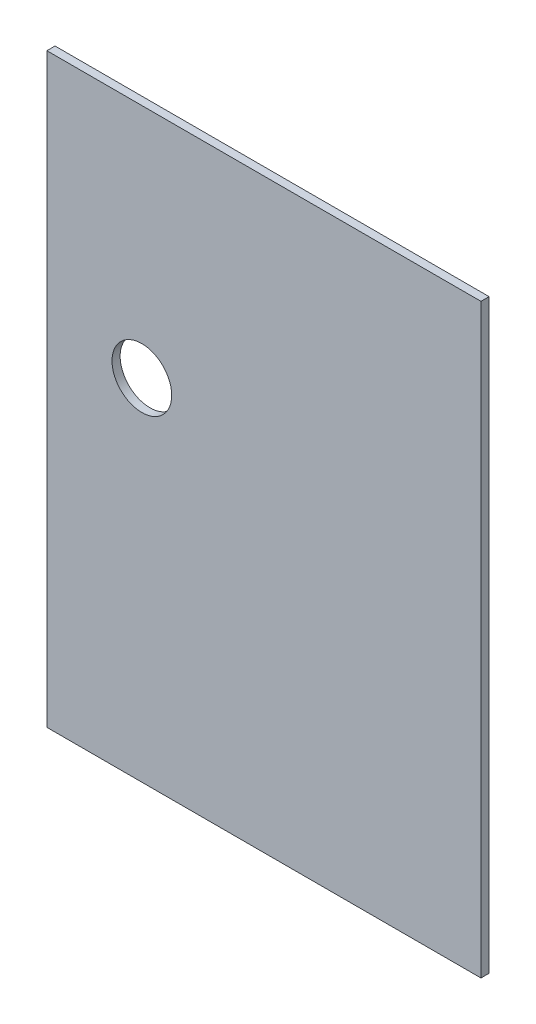
ISO-10303-21;
HEADER;
FILE_DESCRIPTION(('STEP AP214'),'2;1');
FILE_NAME('part.step','',(''),(''),'','','');
FILE_SCHEMA(('AUTOMOTIVE_DESIGN { 1 0 10303 214 1 1 1 1 }'));
ENDSEC;
DATA;
#1=APPLICATION_CONTEXT('core data for automotive mechanical design processes');
#2=APPLICATION_PROTOCOL_DEFINITION('international standard','automotive_design',2000,#1);
#3=PRODUCT_CONTEXT('',#1,'mechanical');
#4=PRODUCT('Part','Part','',(#3));
#5=PRODUCT_RELATED_PRODUCT_CATEGORY('part','',(#4));
#6=PRODUCT_DEFINITION_FORMATION('','',#4);
#7=PRODUCT_DEFINITION_CONTEXT('part definition',#1,'design');
#8=PRODUCT_DEFINITION('design','',#6,#7);
#9=PRODUCT_DEFINITION_SHAPE('','',#8);
#10=(LENGTH_UNIT() NAMED_UNIT(*) SI_UNIT(.MILLI.,.METRE.));
#11=(NAMED_UNIT(*) PLANE_ANGLE_UNIT() SI_UNIT($,.RADIAN.));
#12=(NAMED_UNIT(*) SI_UNIT($,.STERADIAN.) SOLID_ANGLE_UNIT());
#13=UNCERTAINTY_MEASURE_WITH_UNIT(LENGTH_MEASURE(1.E-05),#10,'distance_accuracy_value','');
#14=(GEOMETRIC_REPRESENTATION_CONTEXT(3) GLOBAL_UNCERTAINTY_ASSIGNED_CONTEXT((#13)) GLOBAL_UNIT_ASSIGNED_CONTEXT((#10,
#11,#12)) REPRESENTATION_CONTEXT('',''));
#15=CARTESIAN_POINT('',(0.,0.,0.));
#16=DIRECTION('',(0.,0.,1.));
#17=DIRECTION('',(1.,0.,0.));
#18=AXIS2_PLACEMENT_3D('',#15,#16,#17);
#19=CARTESIAN_POINT('',(0.,0.,3.));
#20=DIRECTION('',(1.,0.,0.));
#21=DIRECTION('',(0.,0.,-1.));
#22=AXIS2_PLACEMENT_3D('',#19,#20,#21);
#23=PLANE('',#22);
#24=DIRECTION('',(0.,-1.,0.));
#25=VECTOR('',#24,1.);
#26=CARTESIAN_POINT('',(0.,0.,0.));
#27=LINE('',#26,#25);
#28=CARTESIAN_POINT('',(0.,216.,0.));
#29=VERTEX_POINT('',#28);
#30=CARTESIAN_POINT('',(0.,0.,0.));
#31=VERTEX_POINT('',#30);
#32=EDGE_CURVE('E114',#29,#31,#27,.T.);
#33=ORIENTED_EDGE('',*,*,#32,.T.);
#34=DIRECTION('',(0.,0.,-1.));
#35=VECTOR('',#34,1.);
#36=CARTESIAN_POINT('',(0.,0.,3.));
#37=LINE('',#36,#35);
#38=CARTESIAN_POINT('',(0.,0.,3.));
#39=VERTEX_POINT('',#38);
#40=EDGE_CURVE('E11',#39,#31,#37,.T.);
#41=ORIENTED_EDGE('',*,*,#40,.F.);
#42=DIRECTION('',(0.,-1.,0.));
#43=VECTOR('',#42,1.);
#44=CARTESIAN_POINT('',(0.,0.,3.));
#45=LINE('',#44,#43);
#46=CARTESIAN_POINT('',(0.,216.,3.));
#47=VERTEX_POINT('',#46);
#48=EDGE_CURVE('E100',#47,#39,#45,.T.);
#49=ORIENTED_EDGE('',*,*,#48,.F.);
#50=DIRECTION('',(0.,0.,-1.));
#51=VECTOR('',#50,1.);
#52=CARTESIAN_POINT('',(0.,216.,3.));
#53=LINE('',#52,#51);
#54=EDGE_CURVE('E108',#47,#29,#53,.T.);
#55=ORIENTED_EDGE('',*,*,#54,.T.);
#56=EDGE_LOOP('',(#33,#41,#49,#55));
#57=FACE_BOUND('',#56,.T.);
#58=ADVANCED_FACE('F44',(#57),#23,.F.);
#59=CARTESIAN_POINT('',(0.,0.,3.));
#60=DIRECTION('',(0.,1.,0.));
#61=DIRECTION('',(0.,0.,1.));
#62=AXIS2_PLACEMENT_3D('',#59,#60,#61);
#63=PLANE('',#62);
#64=DIRECTION('',(1.,0.,0.));
#65=VECTOR('',#64,1.);
#66=CARTESIAN_POINT('',(0.,0.,0.));
#67=LINE('',#66,#65);
#68=CARTESIAN_POINT('',(160.,0.,0.));
#69=VERTEX_POINT('',#68);
#70=EDGE_CURVE('E105',#31,#69,#67,.T.);
#71=ORIENTED_EDGE('',*,*,#70,.T.);
#72=DIRECTION('',(0.,0.,-1.));
#73=VECTOR('',#72,1.);
#74=CARTESIAN_POINT('',(160.,0.,3.));
#75=LINE('',#74,#73);
#76=CARTESIAN_POINT('',(160.,0.,3.));
#77=VERTEX_POINT('',#76);
#78=EDGE_CURVE('E53',#77,#69,#75,.T.);
#79=ORIENTED_EDGE('',*,*,#78,.F.);
#80=DIRECTION('',(1.,0.,0.));
#81=VECTOR('',#80,1.);
#82=CARTESIAN_POINT('',(0.,0.,3.));
#83=LINE('',#82,#81);
#84=EDGE_CURVE('E95',#39,#77,#83,.T.);
#85=ORIENTED_EDGE('',*,*,#84,.F.);
#86=ORIENTED_EDGE('',*,*,#40,.T.);
#87=EDGE_LOOP('',(#71,#79,#85,#86));
#88=FACE_BOUND('',#87,.T.);
#89=ADVANCED_FACE('F101',(#88),#63,.F.);
#90=CARTESIAN_POINT('',(160.,0.,3.));
#91=DIRECTION('',(-1.,0.,0.));
#92=DIRECTION('',(0.,0.,1.));
#93=AXIS2_PLACEMENT_3D('',#90,#91,#92);
#94=PLANE('',#93);
#95=DIRECTION('',(0.,1.,0.));
#96=VECTOR('',#95,1.);
#97=CARTESIAN_POINT('',(160.,0.,0.));
#98=LINE('',#97,#96);
#99=CARTESIAN_POINT('',(160.,216.,0.));
#100=VERTEX_POINT('',#99);
#101=EDGE_CURVE('E80',#69,#100,#98,.T.);
#102=ORIENTED_EDGE('',*,*,#101,.T.);
#103=DIRECTION('',(0.,0.,-1.));
#104=VECTOR('',#103,1.);
#105=CARTESIAN_POINT('',(160.,216.,3.));
#106=LINE('',#105,#104);
#107=CARTESIAN_POINT('',(160.,216.,3.));
#108=VERTEX_POINT('',#107);
#109=EDGE_CURVE('E102',#108,#100,#106,.T.);
#110=ORIENTED_EDGE('',*,*,#109,.F.);
#111=DIRECTION('',(0.,1.,0.));
#112=VECTOR('',#111,1.);
#113=CARTESIAN_POINT('',(160.,0.,3.));
#114=LINE('',#113,#112);
#115=EDGE_CURVE('E92',#77,#108,#114,.T.);
#116=ORIENTED_EDGE('',*,*,#115,.F.);
#117=ORIENTED_EDGE('',*,*,#78,.T.);
#118=EDGE_LOOP('',(#102,#110,#116,#117));
#119=FACE_BOUND('',#118,.T.);
#120=ADVANCED_FACE('F104',(#119),#94,.F.);
#121=CARTESIAN_POINT('',(0.,216.,3.));
#122=DIRECTION('',(0.,-1.,0.));
#123=DIRECTION('',(0.,0.,-1.));
#124=AXIS2_PLACEMENT_3D('',#121,#122,#123);
#125=PLANE('',#124);
#126=DIRECTION('',(-1.,0.,0.));
#127=VECTOR('',#126,1.);
#128=CARTESIAN_POINT('',(0.,216.,0.));
#129=LINE('',#128,#127);
#130=EDGE_CURVE('E84',#100,#29,#129,.T.);
#131=ORIENTED_EDGE('',*,*,#130,.T.);
#132=ORIENTED_EDGE('',*,*,#54,.F.);
#133=DIRECTION('',(-1.,0.,0.));
#134=VECTOR('',#133,1.);
#135=CARTESIAN_POINT('',(0.,216.,3.));
#136=LINE('',#135,#134);
#137=EDGE_CURVE('E64',#108,#47,#136,.T.);
#138=ORIENTED_EDGE('',*,*,#137,.F.);
#139=ORIENTED_EDGE('',*,*,#109,.T.);
#140=EDGE_LOOP('',(#131,#132,#138,#139));
#141=FACE_BOUND('',#140,.T.);
#142=ADVANCED_FACE('F130',(#141),#125,.F.);
#143=CARTESIAN_POINT('',(0.,0.,3.));
#144=DIRECTION('',(0.,0.,-1.));
#145=DIRECTION('',(-1.,0.,0.));
#146=AXIS2_PLACEMENT_3D('',#143,#144,#145);
#147=PLANE('',#146);
#148=CARTESIAN_POINT('',(35.,129.,3.));
#149=DIRECTION('',(0.,0.,1.));
#150=DIRECTION('',(1.,0.,0.));
#151=AXIS2_PLACEMENT_3D('',#148,#149,#150);
#152=CIRCLE('',#151,11.);
#153=CARTESIAN_POINT('',(46.,129.,3.));
#154=VERTEX_POINT('',#153);
#155=EDGE_CURVE('E135',#154,#154,#152,.T.);
#156=ORIENTED_EDGE('',*,*,#155,.F.);
#157=EDGE_LOOP('',(#156));
#158=FACE_BOUND('',#157,.T.);
#159=ORIENTED_EDGE('',*,*,#48,.T.);
#160=ORIENTED_EDGE('',*,*,#84,.T.);
#161=ORIENTED_EDGE('',*,*,#115,.T.);
#162=ORIENTED_EDGE('',*,*,#137,.T.);
#163=EDGE_LOOP('',(#159,#160,#161,#162));
#164=FACE_BOUND('',#163,.T.);
#165=ADVANCED_FACE('F91',(#158,#164),#147,.F.);
#166=CARTESIAN_POINT('',(0.,0.,0.));
#167=DIRECTION('',(0.,0.,-1.));
#168=DIRECTION('',(-1.,0.,0.));
#169=AXIS2_PLACEMENT_3D('',#166,#167,#168);
#170=PLANE('',#169);
#171=CARTESIAN_POINT('',(35.,129.,0.));
#172=DIRECTION('',(0.,0.,1.));
#173=DIRECTION('',(1.,0.,0.));
#174=AXIS2_PLACEMENT_3D('',#171,#172,#173);
#175=CIRCLE('',#174,11.);
#176=CARTESIAN_POINT('',(46.,129.,0.));
#177=VERTEX_POINT('',#176);
#178=EDGE_CURVE('E119',#177,#177,#175,.T.);
#179=ORIENTED_EDGE('',*,*,#178,.T.);
#180=EDGE_LOOP('',(#179));
#181=FACE_BOUND('',#180,.T.);
#182=ORIENTED_EDGE('',*,*,#32,.F.);
#183=ORIENTED_EDGE('',*,*,#130,.F.);
#184=ORIENTED_EDGE('',*,*,#101,.F.);
#185=ORIENTED_EDGE('',*,*,#70,.F.);
#186=EDGE_LOOP('',(#182,#183,#184,#185));
#187=FACE_BOUND('',#186,.T.);
#188=ADVANCED_FACE('F128',(#181,#187),#170,.T.);
#189=CARTESIAN_POINT('',(35.,129.,0.));
#190=DIRECTION('',(0.,0.,1.));
#191=DIRECTION('',(1.,0.,0.));
#192=AXIS2_PLACEMENT_3D('',#189,#190,#191);
#193=CYLINDRICAL_SURFACE('',#192,11.);
#194=ORIENTED_EDGE('',*,*,#178,.F.);
#195=EDGE_LOOP('',(#194));
#196=FACE_BOUND('',#195,.T.);
#197=ORIENTED_EDGE('',*,*,#155,.T.);
#198=EDGE_LOOP('',(#197));
#199=FACE_BOUND('',#198,.T.);
#200=ADVANCED_FACE('F141',(#196,#199),#193,.F.);
#201=CLOSED_SHELL('',(#58,#89,#120,#142,#165,#188,#200));
#202=MANIFOLD_SOLID_BREP('B2',#201);
#203=ADVANCED_BREP_SHAPE_REPRESENTATION('',(#18,#202),#14);
#204=SHAPE_DEFINITION_REPRESENTATION(#9,#203);
ENDSEC;
END-ISO-10303-21;
